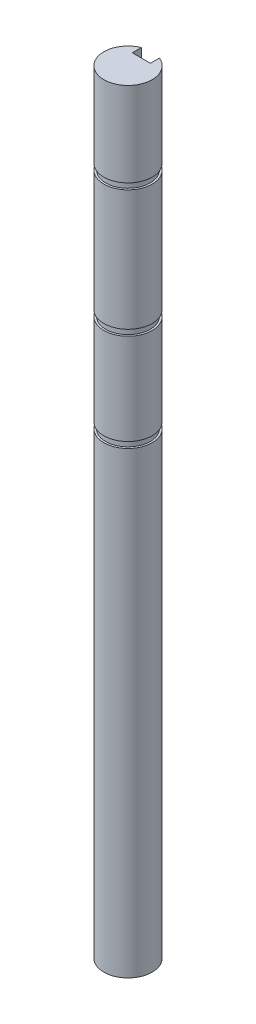
ISO-10303-21;
HEADER;
FILE_DESCRIPTION(('STEP AP214'),'2;1');
FILE_NAME('part.step','',(''),(''),'','','');
FILE_SCHEMA(('AUTOMOTIVE_DESIGN { 1 0 10303 214 1 1 1 1 }'));
ENDSEC;
DATA;
#1=APPLICATION_CONTEXT('core data for automotive mechanical design processes');
#2=APPLICATION_PROTOCOL_DEFINITION('international standard','automotive_design',2000,#1);
#3=PRODUCT_CONTEXT('',#1,'mechanical');
#4=PRODUCT('Part','Part','',(#3));
#5=PRODUCT_RELATED_PRODUCT_CATEGORY('part','',(#4));
#6=PRODUCT_DEFINITION_FORMATION('','',#4);
#7=PRODUCT_DEFINITION_CONTEXT('part definition',#1,'design');
#8=PRODUCT_DEFINITION('design','',#6,#7);
#9=PRODUCT_DEFINITION_SHAPE('','',#8);
#10=(LENGTH_UNIT() NAMED_UNIT(*) SI_UNIT(.MILLI.,.METRE.));
#11=(NAMED_UNIT(*) PLANE_ANGLE_UNIT() SI_UNIT($,.RADIAN.));
#12=(NAMED_UNIT(*) SI_UNIT($,.STERADIAN.) SOLID_ANGLE_UNIT());
#13=UNCERTAINTY_MEASURE_WITH_UNIT(LENGTH_MEASURE(1.E-05),#10,'distance_accuracy_value','');
#14=(GEOMETRIC_REPRESENTATION_CONTEXT(3) GLOBAL_UNCERTAINTY_ASSIGNED_CONTEXT((#13)) GLOBAL_UNIT_ASSIGNED_CONTEXT((#10,
#11,#12)) REPRESENTATION_CONTEXT('',''));
#15=CARTESIAN_POINT('',(0.,0.,0.));
#16=DIRECTION('',(0.,0.,1.));
#17=DIRECTION('',(1.,0.,0.));
#18=AXIS2_PLACEMENT_3D('',#15,#16,#17);
#19=CARTESIAN_POINT('',(0.,101.6,0.));
#20=DIRECTION('',(0.,-1.,0.));
#21=DIRECTION('',(0.,0.,-1.));
#22=AXIS2_PLACEMENT_3D('',#19,#20,#21);
#23=CYLINDRICAL_SURFACE('',#22,3.175);
#24=CARTESIAN_POINT('',(0.,89.7128,0.));
#25=DIRECTION('',(0.,1.,0.));
#26=DIRECTION('',(0.,0.,1.));
#27=AXIS2_PLACEMENT_3D('',#24,#25,#26);
#28=CIRCLE('',#27,3.175);
#29=CARTESIAN_POINT('',(-1.190625,89.7128,-2.94330377456609));
#30=VERTEX_POINT('',#29);
#31=CARTESIAN_POINT('',(1.190625,89.7128,-2.94330377456609));
#32=VERTEX_POINT('',#31);
#33=EDGE_CURVE('E161',#30,#32,#28,.T.);
#34=ORIENTED_EDGE('',*,*,#33,.F.);
#35=DIRECTION('',(0.,-1.,0.));
#36=VECTOR('',#35,1.);
#37=CARTESIAN_POINT('',(-1.190625,101.6,-2.94330377456609));
#38=LINE('',#37,#36);
#39=CARTESIAN_POINT('',(-1.190625,73.8378,-2.94330377456609));
#40=VERTEX_POINT('',#39);
#41=EDGE_CURVE('E230',#30,#40,#38,.T.);
#42=ORIENTED_EDGE('',*,*,#41,.T.);
#43=CARTESIAN_POINT('',(0.,73.8378,0.));
#44=DIRECTION('',(0.,1.,0.));
#45=DIRECTION('',(0.,0.,1.));
#46=AXIS2_PLACEMENT_3D('',#43,#44,#45);
#47=CIRCLE('',#46,3.175);
#48=CARTESIAN_POINT('',(1.190625,73.8378,-2.94330377456609));
#49=VERTEX_POINT('',#48);
#50=EDGE_CURVE('E175',#40,#49,#47,.T.);
#51=ORIENTED_EDGE('',*,*,#50,.T.);
#52=DIRECTION('',(0.,-1.,0.));
#53=VECTOR('',#52,1.);
#54=CARTESIAN_POINT('',(1.190625,101.6,-2.94330377456609));
#55=LINE('',#54,#53);
#56=EDGE_CURVE('E239',#32,#49,#55,.T.);
#57=ORIENTED_EDGE('',*,*,#56,.F.);
#58=EDGE_LOOP('',(#34,#42,#51,#57));
#59=FACE_BOUND('',#58,.T.);
#60=ADVANCED_FACE('F34',(#59),#23,.T.);
#61=CARTESIAN_POINT('',(0.,73.0504,0.));
#62=DIRECTION('',(0.,1.,0.));
#63=DIRECTION('',(0.,0.,1.));
#64=AXIS2_PLACEMENT_3D('',#61,#62,#63);
#65=CIRCLE('',#64,3.175);
#66=CARTESIAN_POINT('',(-1.190625,73.0504,-2.94330377456609));
#67=VERTEX_POINT('',#66);
#68=CARTESIAN_POINT('',(1.190625,73.0504,-2.94330377456609));
#69=VERTEX_POINT('',#68);
#70=EDGE_CURVE('E173',#67,#69,#65,.T.);
#71=ORIENTED_EDGE('',*,*,#70,.F.);
#72=CARTESIAN_POINT('',(-1.190625,61.0616,-2.94330377456609));
#73=VERTEX_POINT('',#72);
#74=EDGE_CURVE('E267',#67,#73,#38,.T.);
#75=ORIENTED_EDGE('',*,*,#74,.T.);
#76=CARTESIAN_POINT('',(0.,61.0616,0.));
#77=DIRECTION('',(0.,1.,0.));
#78=DIRECTION('',(0.,0.,1.));
#79=AXIS2_PLACEMENT_3D('',#76,#77,#78);
#80=CIRCLE('',#79,3.175);
#81=CARTESIAN_POINT('',(1.190625,61.0616,-2.94330377456609));
#82=VERTEX_POINT('',#81);
#83=EDGE_CURVE('E194',#73,#82,#80,.T.);
#84=ORIENTED_EDGE('',*,*,#83,.T.);
#85=EDGE_CURVE('E311',#69,#82,#55,.T.);
#86=ORIENTED_EDGE('',*,*,#85,.F.);
#87=EDGE_LOOP('',(#71,#75,#84,#86));
#88=FACE_BOUND('',#87,.T.);
#89=ADVANCED_FACE('F303',(#88),#23,.T.);
#90=CARTESIAN_POINT('',(0.,60.2742,0.));
#91=DIRECTION('',(0.,1.,0.));
#92=DIRECTION('',(0.,0.,1.));
#93=AXIS2_PLACEMENT_3D('',#90,#91,#92);
#94=CIRCLE('',#93,3.175);
#95=CARTESIAN_POINT('',(-1.190625,60.2742,-2.94330377456609));
#96=VERTEX_POINT('',#95);
#97=CARTESIAN_POINT('',(1.190625,60.2742,-2.94330377456609));
#98=VERTEX_POINT('',#97);
#99=EDGE_CURVE('E191',#96,#98,#94,.T.);
#100=ORIENTED_EDGE('',*,*,#99,.F.);
#101=CARTESIAN_POINT('',(-1.190625,0.,-2.94330377456609));
#102=VERTEX_POINT('',#101);
#103=EDGE_CURVE('E217',#96,#102,#38,.T.);
#104=ORIENTED_EDGE('',*,*,#103,.T.);
#105=CARTESIAN_POINT('',(0.,0.,0.));
#106=DIRECTION('',(0.,1.,0.));
#107=DIRECTION('',(0.,0.,1.));
#108=AXIS2_PLACEMENT_3D('',#105,#106,#107);
#109=CIRCLE('',#108,3.175);
#110=CARTESIAN_POINT('',(1.190625,0.,-2.94330377456609));
#111=VERTEX_POINT('',#110);
#112=EDGE_CURVE('E206',#102,#111,#109,.T.);
#113=ORIENTED_EDGE('',*,*,#112,.T.);
#114=EDGE_CURVE('E236',#98,#111,#55,.T.);
#115=ORIENTED_EDGE('',*,*,#114,.F.);
#116=EDGE_LOOP('',(#100,#104,#113,#115));
#117=FACE_BOUND('',#116,.T.);
#118=ADVANCED_FACE('F275',(#117),#23,.T.);
#119=CARTESIAN_POINT('',(-1.190625,101.6,-2.94330377456609));
#120=VERTEX_POINT('',#119);
#121=CARTESIAN_POINT('',(-1.190625,90.5002,-2.94330377456609));
#122=VERTEX_POINT('',#121);
#123=EDGE_CURVE('E226',#120,#122,#38,.T.);
#124=ORIENTED_EDGE('',*,*,#123,.T.);
#125=CARTESIAN_POINT('',(0.,90.5002,0.));
#126=DIRECTION('',(0.,1.,0.));
#127=DIRECTION('',(0.,0.,1.));
#128=AXIS2_PLACEMENT_3D('',#125,#126,#127);
#129=CIRCLE('',#128,3.175);
#130=CARTESIAN_POINT('',(1.190625,90.5002,-2.94330377456609));
#131=VERTEX_POINT('',#130);
#132=EDGE_CURVE('E154',#122,#131,#129,.T.);
#133=ORIENTED_EDGE('',*,*,#132,.T.);
#134=CARTESIAN_POINT('',(1.190625,101.6,-2.94330377456609));
#135=VERTEX_POINT('',#134);
#136=EDGE_CURVE('E166',#135,#131,#55,.T.);
#137=ORIENTED_EDGE('',*,*,#136,.F.);
#138=CARTESIAN_POINT('',(0.,101.6,0.));
#139=DIRECTION('',(0.,1.,0.));
#140=DIRECTION('',(0.,0.,1.));
#141=AXIS2_PLACEMENT_3D('',#138,#139,#140);
#142=CIRCLE('',#141,3.175);
#143=EDGE_CURVE('E207',#120,#135,#142,.T.);
#144=ORIENTED_EDGE('',*,*,#143,.F.);
#145=EDGE_LOOP('',(#124,#133,#137,#144));
#146=FACE_BOUND('',#145,.T.);
#147=ADVANCED_FACE('F36',(#146),#23,.T.);
#148=CARTESIAN_POINT('',(1.190625,101.6,-1.75267877456609));
#149=DIRECTION('',(1.,0.,0.));
#150=DIRECTION('',(0.,0.,-1.));
#151=AXIS2_PLACEMENT_3D('',#148,#149,#150);
#152=PLANE('',#151);
#153=ORIENTED_EDGE('',*,*,#136,.T.);
#154=DIRECTION('',(0.,0.,1.));
#155=VECTOR('',#154,1.);
#156=CARTESIAN_POINT('',(1.190625,90.5002,-1.75267877456609));
#157=LINE('',#156,#155);
#158=CARTESIAN_POINT('',(1.190625,90.5002,-2.66733070866269));
#159=VERTEX_POINT('',#158);
#160=EDGE_CURVE('E158',#131,#159,#157,.T.);
#161=ORIENTED_EDGE('',*,*,#160,.T.);
#162=DIRECTION('',(0.,-1.,0.));
#163=VECTOR('',#162,1.);
#164=CARTESIAN_POINT('',(1.190625,90.5002,-2.66733070866269));
#165=LINE('',#164,#163);
#166=CARTESIAN_POINT('',(1.190625,89.7128,-2.66733070866269));
#167=VERTEX_POINT('',#166);
#168=EDGE_CURVE('E146',#159,#167,#165,.T.);
#169=ORIENTED_EDGE('',*,*,#168,.T.);
#170=DIRECTION('',(0.,0.,1.));
#171=VECTOR('',#170,1.);
#172=CARTESIAN_POINT('',(1.190625,89.7128,-1.75267877456609));
#173=LINE('',#172,#171);
#174=EDGE_CURVE('E153',#32,#167,#173,.T.);
#175=ORIENTED_EDGE('',*,*,#174,.F.);
#176=ORIENTED_EDGE('',*,*,#56,.T.);
#177=DIRECTION('',(0.,0.,1.));
#178=VECTOR('',#177,1.);
#179=CARTESIAN_POINT('',(1.190625,73.8378,-1.75267877456609));
#180=LINE('',#179,#178);
#181=CARTESIAN_POINT('',(1.190625,73.8378,-2.66733070866269));
#182=VERTEX_POINT('',#181);
#183=EDGE_CURVE('E184',#49,#182,#180,.T.);
#184=ORIENTED_EDGE('',*,*,#183,.T.);
#185=DIRECTION('',(0.,-1.,0.));
#186=VECTOR('',#185,1.);
#187=CARTESIAN_POINT('',(1.190625,73.8378,-2.66733070866269));
#188=LINE('',#187,#186);
#189=CARTESIAN_POINT('',(1.190625,73.0504,-2.66733070866269));
#190=VERTEX_POINT('',#189);
#191=EDGE_CURVE('E178',#182,#190,#188,.T.);
#192=ORIENTED_EDGE('',*,*,#191,.T.);
#193=DIRECTION('',(0.,0.,1.));
#194=VECTOR('',#193,1.);
#195=CARTESIAN_POINT('',(1.190625,73.0504,-1.75267877456609));
#196=LINE('',#195,#194);
#197=EDGE_CURVE('E182',#69,#190,#196,.T.);
#198=ORIENTED_EDGE('',*,*,#197,.F.);
#199=ORIENTED_EDGE('',*,*,#85,.T.);
#200=DIRECTION('',(0.,0.,1.));
#201=VECTOR('',#200,1.);
#202=CARTESIAN_POINT('',(1.190625,61.0616,-1.75267877456609));
#203=LINE('',#202,#201);
#204=CARTESIAN_POINT('',(1.190625,61.0616,-2.66733070866269));
#205=VERTEX_POINT('',#204);
#206=EDGE_CURVE('E203',#82,#205,#203,.T.);
#207=ORIENTED_EDGE('',*,*,#206,.T.);
#208=DIRECTION('',(0.,-1.,0.));
#209=VECTOR('',#208,1.);
#210=CARTESIAN_POINT('',(1.190625,61.0616,-2.66733070866269));
#211=LINE('',#210,#209);
#212=CARTESIAN_POINT('',(1.190625,60.2742,-2.66733070866269));
#213=VERTEX_POINT('',#212);
#214=EDGE_CURVE('E197',#205,#213,#211,.T.);
#215=ORIENTED_EDGE('',*,*,#214,.T.);
#216=DIRECTION('',(0.,0.,1.));
#217=VECTOR('',#216,1.);
#218=CARTESIAN_POINT('',(1.190625,60.2742,-1.75267877456609));
#219=LINE('',#218,#217);
#220=EDGE_CURVE('E201',#98,#213,#219,.T.);
#221=ORIENTED_EDGE('',*,*,#220,.F.);
#222=ORIENTED_EDGE('',*,*,#114,.T.);
#223=DIRECTION('',(0.,0.,1.));
#224=VECTOR('',#223,1.);
#225=CARTESIAN_POINT('',(1.190625,0.,-1.75267877456609));
#226=LINE('',#225,#224);
#227=CARTESIAN_POINT('',(1.190625,0.,-1.75267877456609));
#228=VERTEX_POINT('',#227);
#229=EDGE_CURVE('E220',#111,#228,#226,.T.);
#230=ORIENTED_EDGE('',*,*,#229,.T.);
#231=DIRECTION('',(0.,-1.,0.));
#232=VECTOR('',#231,1.);
#233=CARTESIAN_POINT('',(1.190625,101.6,-1.75267877456609));
#234=LINE('',#233,#232);
#235=CARTESIAN_POINT('',(1.190625,101.6,-1.75267877456609));
#236=VERTEX_POINT('',#235);
#237=EDGE_CURVE('E233',#236,#228,#234,.T.);
#238=ORIENTED_EDGE('',*,*,#237,.F.);
#239=DIRECTION('',(0.,0.,1.));
#240=VECTOR('',#239,1.);
#241=CARTESIAN_POINT('',(1.190625,101.6,-1.75267877456609));
#242=LINE('',#241,#240);
#243=EDGE_CURVE('E210',#135,#236,#242,.T.);
#244=ORIENTED_EDGE('',*,*,#243,.F.);
#245=EDGE_LOOP('',(#153,#161,#169,#175,#176,#184,#192,#198,#199,#207,#215,#221,#222,#230,#238,#244));
#246=FACE_BOUND('',#245,.T.);
#247=ADVANCED_FACE('F164',(#246),#152,.F.);
#248=CARTESIAN_POINT('',(-1.190625,101.6,-1.75267877456609));
#249=DIRECTION('',(0.,0.,1.));
#250=DIRECTION('',(1.,0.,0.));
#251=AXIS2_PLACEMENT_3D('',#248,#249,#250);
#252=PLANE('',#251);
#253=DIRECTION('',(-1.,0.,0.));
#254=VECTOR('',#253,1.);
#255=CARTESIAN_POINT('',(-1.190625,0.,-1.75267877456609));
#256=LINE('',#255,#254);
#257=CARTESIAN_POINT('',(-1.190625,0.,-1.75267877456609));
#258=VERTEX_POINT('',#257);
#259=EDGE_CURVE('E222',#228,#258,#256,.T.);
#260=ORIENTED_EDGE('',*,*,#259,.T.);
#261=DIRECTION('',(0.,-1.,0.));
#262=VECTOR('',#261,1.);
#263=CARTESIAN_POINT('',(-1.190625,101.6,-1.75267877456609));
#264=LINE('',#263,#262);
#265=CARTESIAN_POINT('',(-1.190625,101.6,-1.75267877456609));
#266=VERTEX_POINT('',#265);
#267=EDGE_CURVE('E229',#266,#258,#264,.T.);
#268=ORIENTED_EDGE('',*,*,#267,.F.);
#269=DIRECTION('',(-1.,0.,0.));
#270=VECTOR('',#269,1.);
#271=CARTESIAN_POINT('',(-1.190625,101.6,-1.75267877456609));
#272=LINE('',#271,#270);
#273=EDGE_CURVE('E213',#236,#266,#272,.T.);
#274=ORIENTED_EDGE('',*,*,#273,.F.);
#275=ORIENTED_EDGE('',*,*,#237,.T.);
#276=EDGE_LOOP('',(#260,#268,#274,#275));
#277=FACE_BOUND('',#276,.T.);
#278=ADVANCED_FACE('F290',(#277),#252,.F.);
#279=CARTESIAN_POINT('',(-1.190625,101.6,-2.94330377456609));
#280=DIRECTION('',(-1.,0.,0.));
#281=DIRECTION('',(0.,0.,1.));
#282=AXIS2_PLACEMENT_3D('',#279,#280,#281);
#283=PLANE('',#282);
#284=DIRECTION('',(0.,-1.,0.));
#285=VECTOR('',#284,1.);
#286=CARTESIAN_POINT('',(-1.190625,90.5002,-2.66733070866269));
#287=LINE('',#286,#285);
#288=CARTESIAN_POINT('',(-1.190625,89.7128,-2.66733070866269));
#289=VERTEX_POINT('',#288);
#290=CARTESIAN_POINT('',(-1.190625,90.5002,-2.66733070866269));
#291=VERTEX_POINT('',#290);
#292=EDGE_CURVE('E255',#289,#291,#287,.F.);
#293=ORIENTED_EDGE('',*,*,#292,.T.);
#294=DIRECTION('',(0.,0.,-1.));
#295=VECTOR('',#294,1.);
#296=CARTESIAN_POINT('',(-1.190625,90.5002,-2.94330377456609));
#297=LINE('',#296,#295);
#298=EDGE_CURVE('E11',#291,#122,#297,.T.);
#299=ORIENTED_EDGE('',*,*,#298,.T.);
#300=ORIENTED_EDGE('',*,*,#123,.F.);
#301=DIRECTION('',(0.,0.,-1.));
#302=VECTOR('',#301,1.);
#303=CARTESIAN_POINT('',(-1.190625,101.6,-2.94330377456609));
#304=LINE('',#303,#302);
#305=EDGE_CURVE('E215',#266,#120,#304,.T.);
#306=ORIENTED_EDGE('',*,*,#305,.F.);
#307=ORIENTED_EDGE('',*,*,#267,.T.);
#308=DIRECTION('',(0.,0.,-1.));
#309=VECTOR('',#308,1.);
#310=CARTESIAN_POINT('',(-1.190625,0.,-2.94330377456609));
#311=LINE('',#310,#309);
#312=EDGE_CURVE('E211',#258,#102,#311,.T.);
#313=ORIENTED_EDGE('',*,*,#312,.T.);
#314=ORIENTED_EDGE('',*,*,#103,.F.);
#315=DIRECTION('',(0.,0.,-1.));
#316=VECTOR('',#315,1.);
#317=CARTESIAN_POINT('',(-1.190625,60.2742,-2.94330377456609));
#318=LINE('',#317,#316);
#319=CARTESIAN_POINT('',(-1.190625,60.2742,-2.66733070866269));
#320=VERTEX_POINT('',#319);
#321=EDGE_CURVE('E242',#320,#96,#318,.T.);
#322=ORIENTED_EDGE('',*,*,#321,.F.);
#323=DIRECTION('',(0.,-1.,0.));
#324=VECTOR('',#323,1.);
#325=CARTESIAN_POINT('',(-1.190625,61.0616,-2.66733070866269));
#326=LINE('',#325,#324);
#327=CARTESIAN_POINT('',(-1.190625,61.0616,-2.66733070866269));
#328=VERTEX_POINT('',#327);
#329=EDGE_CURVE('E238',#320,#328,#326,.F.);
#330=ORIENTED_EDGE('',*,*,#329,.T.);
#331=DIRECTION('',(0.,0.,-1.));
#332=VECTOR('',#331,1.);
#333=CARTESIAN_POINT('',(-1.190625,61.0616,-2.94330377456609));
#334=LINE('',#333,#332);
#335=EDGE_CURVE('E244',#328,#73,#334,.T.);
#336=ORIENTED_EDGE('',*,*,#335,.T.);
#337=ORIENTED_EDGE('',*,*,#74,.F.);
#338=DIRECTION('',(0.,0.,-1.));
#339=VECTOR('',#338,1.);
#340=CARTESIAN_POINT('',(-1.190625,73.0504,-2.94330377456609));
#341=LINE('',#340,#339);
#342=CARTESIAN_POINT('',(-1.190625,73.0504,-2.66733070866269));
#343=VERTEX_POINT('',#342);
#344=EDGE_CURVE('E250',#343,#67,#341,.T.);
#345=ORIENTED_EDGE('',*,*,#344,.F.);
#346=DIRECTION('',(0.,-1.,0.));
#347=VECTOR('',#346,1.);
#348=CARTESIAN_POINT('',(-1.190625,73.8378,-2.66733070866269));
#349=LINE('',#348,#347);
#350=CARTESIAN_POINT('',(-1.190625,73.8378,-2.66733070866269));
#351=VERTEX_POINT('',#350);
#352=EDGE_CURVE('E247',#343,#351,#349,.F.);
#353=ORIENTED_EDGE('',*,*,#352,.T.);
#354=DIRECTION('',(0.,0.,-1.));
#355=VECTOR('',#354,1.);
#356=CARTESIAN_POINT('',(-1.190625,73.8378,-2.94330377456609));
#357=LINE('',#356,#355);
#358=EDGE_CURVE('E252',#351,#40,#357,.T.);
#359=ORIENTED_EDGE('',*,*,#358,.T.);
#360=ORIENTED_EDGE('',*,*,#41,.F.);
#361=DIRECTION('',(0.,0.,-1.));
#362=VECTOR('',#361,1.);
#363=CARTESIAN_POINT('',(-1.190625,89.7128,-2.94330377456609));
#364=LINE('',#363,#362);
#365=EDGE_CURVE('E42',#289,#30,#364,.T.);
#366=ORIENTED_EDGE('',*,*,#365,.F.);
#367=EDGE_LOOP('',(#293,#299,#300,#306,#307,#313,#314,#322,#330,#336,#337,#345,#353,#359,#360,#366));
#368=FACE_BOUND('',#367,.T.);
#369=ADVANCED_FACE('F266',(#368),#283,.F.);
#370=CARTESIAN_POINT('',(0.,101.6,0.));
#371=DIRECTION('',(0.,1.,0.));
#372=DIRECTION('',(0.,0.,1.));
#373=AXIS2_PLACEMENT_3D('',#370,#371,#372);
#374=PLANE('',#373);
#375=ORIENTED_EDGE('',*,*,#143,.T.);
#376=ORIENTED_EDGE('',*,*,#243,.T.);
#377=ORIENTED_EDGE('',*,*,#273,.T.);
#378=ORIENTED_EDGE('',*,*,#305,.T.);
#379=EDGE_LOOP('',(#375,#376,#377,#378));
#380=FACE_BOUND('',#379,.T.);
#381=ADVANCED_FACE('F292',(#380),#374,.T.);
#382=CARTESIAN_POINT('',(0.,0.,0.));
#383=DIRECTION('',(0.,1.,0.));
#384=DIRECTION('',(0.,0.,1.));
#385=AXIS2_PLACEMENT_3D('',#382,#383,#384);
#386=PLANE('',#385);
#387=ORIENTED_EDGE('',*,*,#112,.F.);
#388=ORIENTED_EDGE('',*,*,#312,.F.);
#389=ORIENTED_EDGE('',*,*,#259,.F.);
#390=ORIENTED_EDGE('',*,*,#229,.F.);
#391=EDGE_LOOP('',(#387,#388,#389,#390));
#392=FACE_BOUND('',#391,.T.);
#393=ADVANCED_FACE('F285',(#392),#386,.F.);
#394=CARTESIAN_POINT('',(0.,61.0616,0.));
#395=DIRECTION('',(0.,1.,0.));
#396=DIRECTION('',(0.,0.,1.));
#397=AXIS2_PLACEMENT_3D('',#394,#395,#396);
#398=PLANE('',#397);
#399=ORIENTED_EDGE('',*,*,#83,.F.);
#400=ORIENTED_EDGE('',*,*,#335,.F.);
#401=CARTESIAN_POINT('',(0.,61.0616,0.));
#402=DIRECTION('',(0.,1.,0.));
#403=DIRECTION('',(0.,0.,1.));
#404=AXIS2_PLACEMENT_3D('',#401,#402,#403);
#405=CIRCLE('',#404,2.921);
#406=EDGE_CURVE('E188',#328,#205,#405,.T.);
#407=ORIENTED_EDGE('',*,*,#406,.T.);
#408=ORIENTED_EDGE('',*,*,#206,.F.);
#409=EDGE_LOOP('',(#399,#400,#407,#408));
#410=FACE_BOUND('',#409,.T.);
#411=ADVANCED_FACE('F317',(#410),#398,.F.);
#412=CARTESIAN_POINT('',(0.,60.2742,0.));
#413=DIRECTION('',(0.,1.,0.));
#414=DIRECTION('',(0.,0.,1.));
#415=AXIS2_PLACEMENT_3D('',#412,#413,#414);
#416=PLANE('',#415);
#417=ORIENTED_EDGE('',*,*,#220,.T.);
#418=CARTESIAN_POINT('',(0.,60.2742,0.));
#419=DIRECTION('',(0.,1.,0.));
#420=DIRECTION('',(0.,0.,1.));
#421=AXIS2_PLACEMENT_3D('',#418,#419,#420);
#422=CIRCLE('',#421,2.921);
#423=EDGE_CURVE('E187',#320,#213,#422,.T.);
#424=ORIENTED_EDGE('',*,*,#423,.F.);
#425=ORIENTED_EDGE('',*,*,#321,.T.);
#426=ORIENTED_EDGE('',*,*,#99,.T.);
#427=EDGE_LOOP('',(#417,#424,#425,#426));
#428=FACE_BOUND('',#427,.T.);
#429=ADVANCED_FACE('F337',(#428),#416,.T.);
#430=CARTESIAN_POINT('',(0.,61.0616,0.));
#431=DIRECTION('',(0.,-1.,0.));
#432=DIRECTION('',(0.,0.,-1.));
#433=AXIS2_PLACEMENT_3D('',#430,#431,#432);
#434=CYLINDRICAL_SURFACE('',#433,2.921);
#435=ORIENTED_EDGE('',*,*,#406,.F.);
#436=ORIENTED_EDGE('',*,*,#329,.F.);
#437=ORIENTED_EDGE('',*,*,#423,.T.);
#438=ORIENTED_EDGE('',*,*,#214,.F.);
#439=EDGE_LOOP('',(#435,#436,#437,#438));
#440=FACE_BOUND('',#439,.T.);
#441=ADVANCED_FACE('F332',(#440),#434,.T.);
#442=CARTESIAN_POINT('',(0.,73.8378,0.));
#443=DIRECTION('',(0.,1.,0.));
#444=DIRECTION('',(0.,0.,1.));
#445=AXIS2_PLACEMENT_3D('',#442,#443,#444);
#446=PLANE('',#445);
#447=ORIENTED_EDGE('',*,*,#50,.F.);
#448=ORIENTED_EDGE('',*,*,#358,.F.);
#449=CARTESIAN_POINT('',(0.,73.8378,0.));
#450=DIRECTION('',(0.,1.,0.));
#451=DIRECTION('',(0.,0.,1.));
#452=AXIS2_PLACEMENT_3D('',#449,#450,#451);
#453=CIRCLE('',#452,2.921);
#454=EDGE_CURVE('E57',#351,#182,#453,.T.);
#455=ORIENTED_EDGE('',*,*,#454,.T.);
#456=ORIENTED_EDGE('',*,*,#183,.F.);
#457=EDGE_LOOP('',(#447,#448,#455,#456));
#458=FACE_BOUND('',#457,.T.);
#459=ADVANCED_FACE('F321',(#458),#446,.F.);
#460=CARTESIAN_POINT('',(0.,73.0504,0.));
#461=DIRECTION('',(0.,1.,0.));
#462=DIRECTION('',(0.,0.,1.));
#463=AXIS2_PLACEMENT_3D('',#460,#461,#462);
#464=PLANE('',#463);
#465=ORIENTED_EDGE('',*,*,#197,.T.);
#466=CARTESIAN_POINT('',(0.,73.0504,0.));
#467=DIRECTION('',(0.,1.,0.));
#468=DIRECTION('',(0.,0.,1.));
#469=AXIS2_PLACEMENT_3D('',#466,#467,#468);
#470=CIRCLE('',#469,2.921);
#471=EDGE_CURVE('E167',#343,#190,#470,.T.);
#472=ORIENTED_EDGE('',*,*,#471,.F.);
#473=ORIENTED_EDGE('',*,*,#344,.T.);
#474=ORIENTED_EDGE('',*,*,#70,.T.);
#475=EDGE_LOOP('',(#465,#472,#473,#474));
#476=FACE_BOUND('',#475,.T.);
#477=ADVANCED_FACE('F324',(#476),#464,.T.);
#478=CARTESIAN_POINT('',(0.,73.8378,0.));
#479=DIRECTION('',(0.,-1.,0.));
#480=DIRECTION('',(0.,0.,-1.));
#481=AXIS2_PLACEMENT_3D('',#478,#479,#480);
#482=CYLINDRICAL_SURFACE('',#481,2.921);
#483=ORIENTED_EDGE('',*,*,#454,.F.);
#484=ORIENTED_EDGE('',*,*,#352,.F.);
#485=ORIENTED_EDGE('',*,*,#471,.T.);
#486=ORIENTED_EDGE('',*,*,#191,.F.);
#487=EDGE_LOOP('',(#483,#484,#485,#486));
#488=FACE_BOUND('',#487,.T.);
#489=ADVANCED_FACE('F323',(#488),#482,.T.);
#490=CARTESIAN_POINT('',(0.,90.5002,0.));
#491=DIRECTION('',(0.,1.,0.));
#492=DIRECTION('',(0.,0.,1.));
#493=AXIS2_PLACEMENT_3D('',#490,#491,#492);
#494=PLANE('',#493);
#495=ORIENTED_EDGE('',*,*,#132,.F.);
#496=ORIENTED_EDGE('',*,*,#298,.F.);
#497=CARTESIAN_POINT('',(0.,90.5002,0.));
#498=DIRECTION('',(0.,1.,0.));
#499=DIRECTION('',(0.,0.,1.));
#500=AXIS2_PLACEMENT_3D('',#497,#498,#499);
#501=CIRCLE('',#500,2.921);
#502=EDGE_CURVE('E49',#291,#159,#501,.T.);
#503=ORIENTED_EDGE('',*,*,#502,.T.);
#504=ORIENTED_EDGE('',*,*,#160,.F.);
#505=EDGE_LOOP('',(#495,#496,#503,#504));
#506=FACE_BOUND('',#505,.T.);
#507=ADVANCED_FACE('F157',(#506),#494,.F.);
#508=CARTESIAN_POINT('',(0.,89.7128,0.));
#509=DIRECTION('',(0.,1.,0.));
#510=DIRECTION('',(0.,0.,1.));
#511=AXIS2_PLACEMENT_3D('',#508,#509,#510);
#512=PLANE('',#511);
#513=ORIENTED_EDGE('',*,*,#174,.T.);
#514=CARTESIAN_POINT('',(0.,89.7128,0.));
#515=DIRECTION('',(0.,1.,0.));
#516=DIRECTION('',(0.,0.,1.));
#517=AXIS2_PLACEMENT_3D('',#514,#515,#516);
#518=CIRCLE('',#517,2.921);
#519=EDGE_CURVE('E149',#289,#167,#518,.T.);
#520=ORIENTED_EDGE('',*,*,#519,.F.);
#521=ORIENTED_EDGE('',*,*,#365,.T.);
#522=ORIENTED_EDGE('',*,*,#33,.T.);
#523=EDGE_LOOP('',(#513,#520,#521,#522));
#524=FACE_BOUND('',#523,.T.);
#525=ADVANCED_FACE('F259',(#524),#512,.T.);
#526=CARTESIAN_POINT('',(0.,90.5002,0.));
#527=DIRECTION('',(0.,-1.,0.));
#528=DIRECTION('',(0.,0.,-1.));
#529=AXIS2_PLACEMENT_3D('',#526,#527,#528);
#530=CYLINDRICAL_SURFACE('',#529,2.921);
#531=ORIENTED_EDGE('',*,*,#502,.F.);
#532=ORIENTED_EDGE('',*,*,#292,.F.);
#533=ORIENTED_EDGE('',*,*,#519,.T.);
#534=ORIENTED_EDGE('',*,*,#168,.F.);
#535=EDGE_LOOP('',(#531,#532,#533,#534));
#536=FACE_BOUND('',#535,.T.);
#537=ADVANCED_FACE('F147',(#536),#530,.T.);
#538=CLOSED_SHELL('',(#60,#89,#118,#147,#247,#278,#369,#381,#393,#411,#429,#441,#459,#477,#489,
#507,#525,#537));
#539=MANIFOLD_SOLID_BREP('B2',#538);
#540=ADVANCED_BREP_SHAPE_REPRESENTATION('',(#18,#539),#14);
#541=SHAPE_DEFINITION_REPRESENTATION(#9,#540);
ENDSEC;
END-ISO-10303-21;
